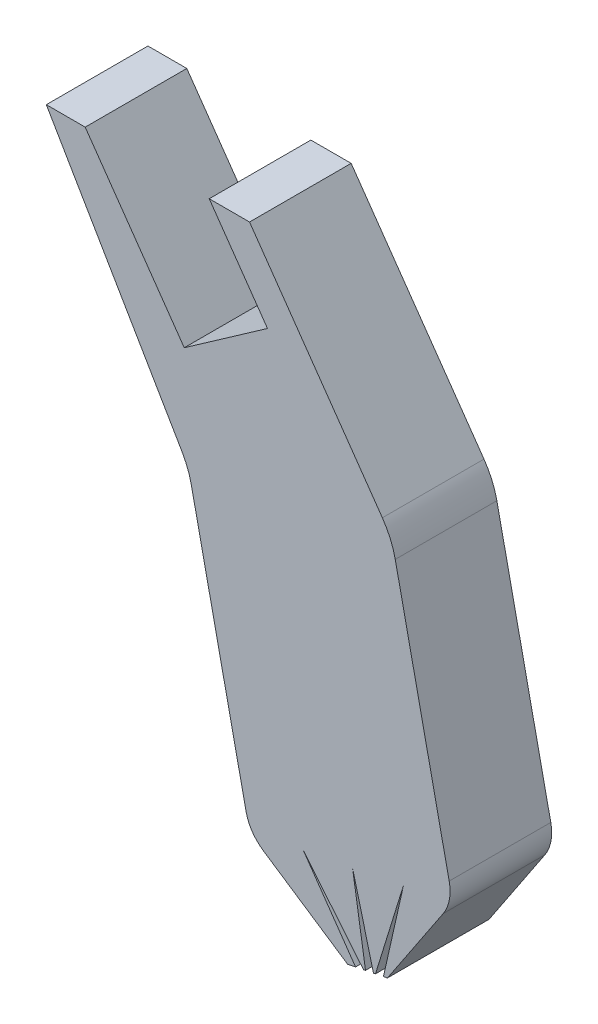
ISO-10303-21;
HEADER;
FILE_DESCRIPTION(('STEP AP214'),'2;1');
FILE_NAME('part.step','',(''),(''),'','','');
FILE_SCHEMA(('AUTOMOTIVE_DESIGN { 1 0 10303 214 1 1 1 1 }'));
ENDSEC;
DATA;
#1=APPLICATION_CONTEXT('core data for automotive mechanical design processes');
#2=APPLICATION_PROTOCOL_DEFINITION('international standard','automotive_design',2000,#1);
#3=PRODUCT_CONTEXT('',#1,'mechanical');
#4=PRODUCT('Part','Part','',(#3));
#5=PRODUCT_RELATED_PRODUCT_CATEGORY('part','',(#4));
#6=PRODUCT_DEFINITION_FORMATION('','',#4);
#7=PRODUCT_DEFINITION_CONTEXT('part definition',#1,'design');
#8=PRODUCT_DEFINITION('design','',#6,#7);
#9=PRODUCT_DEFINITION_SHAPE('','',#8);
#10=(LENGTH_UNIT() NAMED_UNIT(*) SI_UNIT(.MILLI.,.METRE.));
#11=(NAMED_UNIT(*) PLANE_ANGLE_UNIT() SI_UNIT($,.RADIAN.));
#12=(NAMED_UNIT(*) SI_UNIT($,.STERADIAN.) SOLID_ANGLE_UNIT());
#13=UNCERTAINTY_MEASURE_WITH_UNIT(LENGTH_MEASURE(1.E-05),#10,'distance_accuracy_value','');
#14=(GEOMETRIC_REPRESENTATION_CONTEXT(3) GLOBAL_UNCERTAINTY_ASSIGNED_CONTEXT((#13)) GLOBAL_UNIT_ASSIGNED_CONTEXT((#10,
#11,#12)) REPRESENTATION_CONTEXT('',''));
#15=CARTESIAN_POINT('',(0.,0.,0.));
#16=DIRECTION('',(0.,0.,1.));
#17=DIRECTION('',(1.,0.,0.));
#18=AXIS2_PLACEMENT_3D('',#15,#16,#17);
#19=CARTESIAN_POINT('',(7.01256561130721,-61.1492493326048,13.75));
#20=DIRECTION('',(0.,-1.,0.));
#21=DIRECTION('',(0.,0.,-1.));
#22=AXIS2_PLACEMENT_3D('',#19,#20,#21);
#23=PLANE('',#22);
#24=DIRECTION('',(-1.,0.,0.));
#25=VECTOR('',#24,1.);
#26=CARTESIAN_POINT('',(7.01256561130721,-61.1492493326048,13.75));
#27=LINE('',#26,#25);
#28=CARTESIAN_POINT('',(2.96914406359542,-61.1492493326048,13.75));
#29=VERTEX_POINT('',#28);
#30=CARTESIAN_POINT('',(2.01256561130721,-61.1492493326048,13.75));
#31=VERTEX_POINT('',#30);
#32=EDGE_CURVE('E350',#29,#31,#27,.T.);
#33=ORIENTED_EDGE('',*,*,#32,.F.);
#34=DIRECTION('',(0.,0.,-1.));
#35=VECTOR('',#34,1.);
#36=CARTESIAN_POINT('',(2.96914406359542,-61.1492493326048,13.751));
#37=LINE('',#36,#35);
#38=CARTESIAN_POINT('',(2.96914406359542,-61.1492493326048,11.25));
#39=VERTEX_POINT('',#38);
#40=EDGE_CURVE('E453',#29,#39,#37,.T.);
#41=ORIENTED_EDGE('',*,*,#40,.T.);
#42=DIRECTION('',(-1.,0.,0.));
#43=VECTOR('',#42,1.);
#44=CARTESIAN_POINT('',(7.01256561130721,-61.1492493326048,11.25));
#45=LINE('',#44,#43);
#46=CARTESIAN_POINT('',(2.01256561130721,-61.1492493326048,11.25));
#47=VERTEX_POINT('',#46);
#48=EDGE_CURVE('E253',#39,#47,#45,.T.);
#49=ORIENTED_EDGE('',*,*,#48,.T.);
#50=DIRECTION('',(0.,0.,-1.));
#51=VECTOR('',#50,1.);
#52=CARTESIAN_POINT('',(2.01256561130721,-61.1492493326048,13.75));
#53=LINE('',#52,#51);
#54=EDGE_CURVE('E277',#31,#47,#53,.T.);
#55=ORIENTED_EDGE('',*,*,#54,.F.);
#56=EDGE_LOOP('',(#33,#41,#49,#55));
#57=FACE_BOUND('',#56,.T.);
#58=ADVANCED_FACE('F57',(#57),#23,.F.);
#59=CARTESIAN_POINT('',(7.01256561130721,-61.1492493326048,13.75));
#60=DIRECTION('',(0.,0.,-1.));
#61=DIRECTION('',(-1.,0.,0.));
#62=AXIS2_PLACEMENT_3D('',#59,#60,#61);
#63=PLANE('',#62);
#64=DIRECTION('',(0.819231920519041,0.573462344363328,0.));
#65=VECTOR('',#64,1.);
#66=CARTESIAN_POINT('',(7.45443882843717,-63.1973291339024,13.75));
#67=LINE('',#66,#65);
#68=CARTESIAN_POINT('',(5.40635902713957,-64.6309849948108,13.75));
#69=VERTEX_POINT('',#68);
#70=CARTESIAN_POINT('',(7.45443882843717,-63.1973291339024,13.75));
#71=VERTEX_POINT('',#70);
#72=EDGE_CURVE('E470',#69,#71,#67,.T.);
#73=ORIENTED_EDGE('',*,*,#72,.F.);
#74=DIRECTION('',(0.573462344363329,-0.81923192051904,0.));
#75=VECTOR('',#74,1.);
#76=CARTESIAN_POINT('',(5.40635902713957,-64.6309849948108,13.75));
#77=LINE('',#76,#75);
#78=EDGE_CURVE('E246',#29,#69,#77,.T.);
#79=ORIENTED_EDGE('',*,*,#78,.F.);
#80=ORIENTED_EDGE('',*,*,#32,.T.);
#81=DIRECTION('',(0.503871025524086,-0.863778900898433,0.));
#82=VECTOR('',#81,1.);
#83=CARTESIAN_POINT('',(2.01256561130721,-61.1492493326048,13.75));
#84=LINE('',#83,#82);
#85=CARTESIAN_POINT('',(5.3514971074723,-66.8731318974593,13.75));
#86=VERTEX_POINT('',#85);
#87=EDGE_CURVE('E343',#31,#86,#84,.T.);
#88=ORIENTED_EDGE('',*,*,#87,.T.);
#89=CARTESIAN_POINT('',(3.62393930567543,-67.8808739485075,13.75));
#90=DIRECTION('',(0.,0.,-1.));
#91=DIRECTION('',(-1.,0.,0.));
#92=AXIS2_PLACEMENT_3D('',#89,#90,#91);
#93=CIRCLE('',#92,2.);
#94=CARTESIAN_POINT('',(5.57954413383025,-67.4618157710457,13.75));
#95=VERTEX_POINT('',#94);
#96=EDGE_CURVE('E322',#86,#95,#93,.T.);
#97=ORIENTED_EDGE('',*,*,#96,.T.);
#98=DIRECTION('',(0.209529088730873,-0.97780241407741,0.));
#99=VECTOR('',#98,1.);
#100=CARTESIAN_POINT('',(5.51256561130721,-67.1492493326048,13.75));
#101=LINE('',#100,#99);
#102=CARTESIAN_POINT('',(6.92745234621416,-73.752054095504,13.75));
#103=VERTEX_POINT('',#102);
#104=EDGE_CURVE('E340',#95,#103,#101,.T.);
#105=ORIENTED_EDGE('',*,*,#104,.T.);
#106=CARTESIAN_POINT('',(7.90525476029157,-73.5425250067731,13.75));
#107=DIRECTION('',(0.,0.,-1.));
#108=DIRECTION('',(-1.,0.,0.));
#109=AXIS2_PLACEMENT_3D('',#106,#107,#108);
#110=CIRCLE('',#109,1.);
#111=CARTESIAN_POINT('',(7.35055456406634,-74.3745753011109,13.75));
#112=VERTEX_POINT('',#111);
#113=EDGE_CURVE('E302',#103,#112,#110,.F.);
#114=ORIENTED_EDGE('',*,*,#113,.T.);
#115=DIRECTION('',(0.832050294337844,-0.554700196225228,0.));
#116=VECTOR('',#115,1.);
#117=CARTESIAN_POINT('',(7.01256561130721,-74.1492493326049,13.75));
#118=LINE('',#117,#116);
#119=CARTESIAN_POINT('',(9.42421720589266,-75.7570170623285,13.75));
#120=VERTEX_POINT('',#119);
#121=EDGE_CURVE('E337',#112,#120,#118,.T.);
#122=ORIENTED_EDGE('',*,*,#121,.T.);
#123=DIRECTION('',(0.98058067569092,0.196116135138183,0.));
#124=VECTOR('',#123,1.);
#125=CARTESIAN_POINT('',(9.42421720589266,-75.7570170623285,13.75));
#126=LINE('',#125,#124);
#127=CARTESIAN_POINT('',(9.62033334103085,-75.7177938353008,13.75));
#128=VERTEX_POINT('',#127);
#129=EDGE_CURVE('E362',#120,#128,#126,.T.);
#130=ORIENTED_EDGE('',*,*,#129,.T.);
#131=DIRECTION('',(0.571787228868899,-0.820401953253663,0.));
#132=VECTOR('',#131,1.);
#133=CARTESIAN_POINT('',(1.93371148372192,-64.6890067843322,13.75));
#134=LINE('',#133,#132);
#135=CARTESIAN_POINT('',(8.34183175812095,-73.8833961032422,13.75));
#136=VERTEX_POINT('',#135);
#137=EDGE_CURVE('E409',#136,#128,#134,.T.);
#138=ORIENTED_EDGE('',*,*,#137,.F.);
#139=DIRECTION('',(-0.634742016422739,0.772724124502138,0.));
#140=VECTOR('',#139,1.);
#141=CARTESIAN_POINT('',(1.5604235678015,-65.6278252237713,13.75));
#142=LINE('',#141,#140);
#143=CARTESIAN_POINT('',(9.81644947616903,-75.6785706082732,13.75));
#144=VERTEX_POINT('',#143);
#145=EDGE_CURVE('E419',#144,#136,#142,.T.);
#146=ORIENTED_EDGE('',*,*,#145,.F.);
#147=CARTESIAN_POINT('',(9.86547850995357,-75.6687648015163,13.75));
#148=VERTEX_POINT('',#147);
#149=EDGE_CURVE('E376',#144,#148,#126,.T.);
#150=ORIENTED_EDGE('',*,*,#149,.T.);
#151=DIRECTION('',(0.155359100364853,-0.987858061633261,0.));
#152=VECTOR('',#151,1.);
#153=CARTESIAN_POINT('',(7.56826950147012,-61.0618545339004,13.75));
#154=LINE('',#153,#152);
#155=CARTESIAN_POINT('',(9.54679539118253,-73.6424033766298,13.75));
#156=VERTEX_POINT('',#155);
#157=EDGE_CURVE('E382',#156,#148,#154,.T.);
#158=ORIENTED_EDGE('',*,*,#157,.F.);
#159=DIRECTION('',(-0.250786539192191,0.968042412170047,0.));
#160=VECTOR('',#159,1.);
#161=CARTESIAN_POINT('',(6.35441975385762,-61.3197523186295,13.75));
#162=LINE('',#161,#160);
#163=CARTESIAN_POINT('',(10.0615946450918,-75.6295415744886,13.75));
#164=VERTEX_POINT('',#163);
#165=EDGE_CURVE('E394',#164,#156,#162,.T.);
#166=ORIENTED_EDGE('',*,*,#165,.F.);
#167=CARTESIAN_POINT('',(10.1106236788763,-75.6197357677317,13.75));
#168=VERTEX_POINT('',#167);
#169=EDGE_CURVE('E485',#164,#168,#126,.T.);
#170=ORIENTED_EDGE('',*,*,#169,.T.);
#171=DIRECTION('',(0.295420455509128,0.955367340067044,0.));
#172=VECTOR('',#171,1.);
#173=CARTESIAN_POINT('',(13.9243246281971,-63.2865162366584,13.75));
#174=LINE('',#173,#172);
#175=CARTESIAN_POINT('',(10.799532813685,-73.3918558921293,13.75));
#176=VERTEX_POINT('',#175);
#177=EDGE_CURVE('E442',#168,#176,#174,.T.);
#178=ORIENTED_EDGE('',*,*,#177,.T.);
#179=DIRECTION('',(-0.219658671350537,-0.975576787393241,0.));
#180=VECTOR('',#179,1.);
#181=CARTESIAN_POINT('',(13.2403278211245,-62.5514782398248,13.75));
#182=LINE('',#181,#180);
#183=CARTESIAN_POINT('',(10.3067398140145,-75.5805125407041,13.75));
#184=VERTEX_POINT('',#183);
#185=EDGE_CURVE('E432',#176,#184,#182,.T.);
#186=ORIENTED_EDGE('',*,*,#185,.T.);
#187=CARTESIAN_POINT('',(10.4047978815836,-75.5609009271903,13.75));
#188=VERTEX_POINT('',#187);
#189=EDGE_CURVE('E370',#184,#188,#126,.T.);
#190=ORIENTED_EDGE('',*,*,#189,.T.);
#191=DIRECTION('',(0.554700196225229,0.832050294337844,0.));
#192=VECTOR('',#191,1.);
#193=CARTESIAN_POINT('',(10.0125656113072,-76.1492493326048,13.75));
#194=LINE('',#193,#192);
#195=CARTESIAN_POINT('',(11.7783376366465,-73.5005912945958,13.75));
#196=VERTEX_POINT('',#195);
#197=EDGE_CURVE('E334',#188,#196,#194,.T.);
#198=ORIENTED_EDGE('',*,*,#197,.T.);
#199=CARTESIAN_POINT('',(10.9462873423087,-72.9458910983706,13.75));
#200=DIRECTION('',(0.,0.,-1.));
#201=DIRECTION('',(-1.,0.,0.));
#202=AXIS2_PLACEMENT_3D('',#199,#200,#201);
#203=CIRCLE('',#202,1.);
#204=CARTESIAN_POINT('',(11.9240897563861,-72.7363620096397,13.75));
#205=VERTEX_POINT('',#204);
#206=EDGE_CURVE('E299',#196,#205,#203,.F.);
#207=ORIENTED_EDGE('',*,*,#206,.T.);
#208=DIRECTION('',(-0.209529088730873,0.97780241407741,0.));
#209=VECTOR('',#208,1.);
#210=CARTESIAN_POINT('',(12.0125656113072,-73.1492493326048,13.75));
#211=LINE('',#210,#209);
#212=CARTESIAN_POINT('',(10.5974327748816,-66.5452960959522,13.75));
#213=VERTEX_POINT('',#212);
#214=EDGE_CURVE('E281',#205,#213,#211,.T.);
#215=ORIENTED_EDGE('',*,*,#214,.T.);
#216=CARTESIAN_POINT('',(8.64182794672682,-66.9643542734139,13.75));
#217=DIRECTION('',(0.,0.,-1.));
#218=DIRECTION('',(-1.,0.,0.));
#219=AXIS2_PLACEMENT_3D('',#216,#217,#218);
#220=CIRCLE('',#219,2.);
#221=CARTESIAN_POINT('',(10.2802917877649,-65.8174295846872,13.75));
#222=VERTEX_POINT('',#221);
#223=EDGE_CURVE('E12',#213,#222,#220,.F.);
#224=ORIENTED_EDGE('',*,*,#223,.T.);
#225=DIRECTION('',(-0.573462344363329,0.81923192051904,0.));
#226=VECTOR('',#225,1.);
#227=CARTESIAN_POINT('',(10.5125656113072,-66.1492493326048,13.75));
#228=LINE('',#227,#226);
#229=CARTESIAN_POINT('',(7.01256561130721,-61.1492493326048,13.75));
#230=VERTEX_POINT('',#229);
#231=EDGE_CURVE('E276',#222,#230,#228,.T.);
#232=ORIENTED_EDGE('',*,*,#231,.T.);
#233=CARTESIAN_POINT('',(6.02078296752884,-61.1492493326048,13.75));
#234=VERTEX_POINT('',#233);
#235=EDGE_CURVE('E347',#230,#234,#27,.T.);
#236=ORIENTED_EDGE('',*,*,#235,.T.);
#237=DIRECTION('',(-0.57346234436333,0.819231920519039,0.));
#238=VECTOR('',#237,1.);
#239=CARTESIAN_POINT('',(6.02078296752884,-61.1492493326048,13.75));
#240=LINE('',#239,#238);
#241=EDGE_CURVE('E73',#71,#234,#240,.T.);
#242=ORIENTED_EDGE('',*,*,#241,.F.);
#243=EDGE_LOOP('',(#73,#79,#80,#88,#97,#105,#114,#122,#130,#138,#146,#150,#158,#166,#170,#178,
#186,#190,#198,#207,#215,#224,#232,#236,#242));
#244=FACE_BOUND('',#243,.T.);
#245=ADVANCED_FACE('F477',(#244),#63,.F.);
#246=CARTESIAN_POINT('',(7.01256561130721,-61.1492493326048,11.25));
#247=DIRECTION('',(0.,0.,-1.));
#248=DIRECTION('',(-1.,0.,0.));
#249=AXIS2_PLACEMENT_3D('',#246,#247,#248);
#250=PLANE('',#249);
#251=DIRECTION('',(-0.573462344363329,0.81923192051904,0.));
#252=VECTOR('',#251,1.);
#253=CARTESIAN_POINT('',(5.40635902713957,-64.6309849948108,11.25));
#254=LINE('',#253,#252);
#255=CARTESIAN_POINT('',(5.40635902713957,-64.6309849948108,11.25));
#256=VERTEX_POINT('',#255);
#257=EDGE_CURVE('E234',#256,#39,#254,.T.);
#258=ORIENTED_EDGE('',*,*,#257,.F.);
#259=DIRECTION('',(-0.81923192051904,-0.573462344363328,0.));
#260=VECTOR('',#259,1.);
#261=CARTESIAN_POINT('',(7.45443882843717,-63.1973291339024,11.25));
#262=LINE('',#261,#260);
#263=CARTESIAN_POINT('',(7.45443882843717,-63.1973291339024,11.25));
#264=VERTEX_POINT('',#263);
#265=EDGE_CURVE('E244',#264,#256,#262,.T.);
#266=ORIENTED_EDGE('',*,*,#265,.F.);
#267=DIRECTION('',(0.57346234436333,-0.819231920519039,0.));
#268=VECTOR('',#267,1.);
#269=CARTESIAN_POINT('',(6.02078296752884,-61.1492493326048,11.25));
#270=LINE('',#269,#268);
#271=CARTESIAN_POINT('',(6.02078296752884,-61.1492493326048,11.25));
#272=VERTEX_POINT('',#271);
#273=EDGE_CURVE('E226',#272,#264,#270,.T.);
#274=ORIENTED_EDGE('',*,*,#273,.F.);
#275=CARTESIAN_POINT('',(7.01256561130721,-61.1492493326048,11.25));
#276=VERTEX_POINT('',#275);
#277=EDGE_CURVE('E241',#276,#272,#45,.T.);
#278=ORIENTED_EDGE('',*,*,#277,.F.);
#279=DIRECTION('',(-0.573462344363329,0.81923192051904,0.));
#280=VECTOR('',#279,1.);
#281=CARTESIAN_POINT('',(10.5125656113072,-66.1492493326048,11.25));
#282=LINE('',#281,#280);
#283=CARTESIAN_POINT('',(10.2802917877649,-65.8174295846872,11.25));
#284=VERTEX_POINT('',#283);
#285=EDGE_CURVE('E260',#284,#276,#282,.T.);
#286=ORIENTED_EDGE('',*,*,#285,.F.);
#287=CARTESIAN_POINT('',(8.64182794672682,-66.9643542734139,11.25));
#288=DIRECTION('',(0.,0.,-1.));
#289=DIRECTION('',(-1.,0.,0.));
#290=AXIS2_PLACEMENT_3D('',#287,#288,#289);
#291=CIRCLE('',#290,2.);
#292=CARTESIAN_POINT('',(10.5974327748816,-66.5452960959522,11.25));
#293=VERTEX_POINT('',#292);
#294=EDGE_CURVE('E329',#284,#293,#291,.T.);
#295=ORIENTED_EDGE('',*,*,#294,.T.);
#296=DIRECTION('',(-0.209529088730873,0.97780241407741,0.));
#297=VECTOR('',#296,1.);
#298=CARTESIAN_POINT('',(12.0125656113072,-73.1492493326048,11.25));
#299=LINE('',#298,#297);
#300=CARTESIAN_POINT('',(11.9240897563861,-72.7363620096397,11.25));
#301=VERTEX_POINT('',#300);
#302=EDGE_CURVE('E273',#301,#293,#299,.T.);
#303=ORIENTED_EDGE('',*,*,#302,.F.);
#304=CARTESIAN_POINT('',(10.9462873423087,-72.9458910983706,11.25));
#305=DIRECTION('',(0.,0.,-1.));
#306=DIRECTION('',(-1.,0.,0.));
#307=AXIS2_PLACEMENT_3D('',#304,#305,#306);
#308=CIRCLE('',#307,1.);
#309=CARTESIAN_POINT('',(11.7783376366465,-73.5005912945958,11.25));
#310=VERTEX_POINT('',#309);
#311=EDGE_CURVE('E288',#301,#310,#308,.T.);
#312=ORIENTED_EDGE('',*,*,#311,.T.);
#313=DIRECTION('',(0.554700196225229,0.832050294337844,0.));
#314=VECTOR('',#313,1.);
#315=CARTESIAN_POINT('',(10.0125656113072,-76.1492493326048,11.25));
#316=LINE('',#315,#314);
#317=CARTESIAN_POINT('',(10.4047978815836,-75.5609009271903,11.25));
#318=VERTEX_POINT('',#317);
#319=EDGE_CURVE('E269',#318,#310,#316,.T.);
#320=ORIENTED_EDGE('',*,*,#319,.F.);
#321=DIRECTION('',(0.98058067569092,0.196116135138183,0.));
#322=VECTOR('',#321,1.);
#323=CARTESIAN_POINT('',(9.42421720589266,-75.7570170623285,11.25));
#324=LINE('',#323,#322);
#325=CARTESIAN_POINT('',(10.3067398140145,-75.5805125407041,11.25));
#326=VERTEX_POINT('',#325);
#327=EDGE_CURVE('E372',#326,#318,#324,.T.);
#328=ORIENTED_EDGE('',*,*,#327,.F.);
#329=DIRECTION('',(-0.219658671350537,-0.975576787393241,0.));
#330=VECTOR('',#329,1.);
#331=CARTESIAN_POINT('',(13.2403278211245,-62.5514782398248,11.25));
#332=LINE('',#331,#330);
#333=CARTESIAN_POINT('',(10.799532813685,-73.3918558921293,11.25));
#334=VERTEX_POINT('',#333);
#335=EDGE_CURVE('E439',#334,#326,#332,.T.);
#336=ORIENTED_EDGE('',*,*,#335,.F.);
#337=DIRECTION('',(0.295420455509128,0.955367340067044,0.));
#338=VECTOR('',#337,1.);
#339=CARTESIAN_POINT('',(13.9243246281971,-63.2865162366584,11.25));
#340=LINE('',#339,#338);
#341=CARTESIAN_POINT('',(10.1106236788763,-75.6197357677317,11.25));
#342=VERTEX_POINT('',#341);
#343=EDGE_CURVE('E389',#342,#334,#340,.T.);
#344=ORIENTED_EDGE('',*,*,#343,.F.);
#345=CARTESIAN_POINT('',(10.0615946450918,-75.6295415744886,11.25));
#346=VERTEX_POINT('',#345);
#347=EDGE_CURVE('E491',#346,#342,#324,.T.);
#348=ORIENTED_EDGE('',*,*,#347,.F.);
#349=DIRECTION('',(-0.250786539192191,0.968042412170047,0.));
#350=VECTOR('',#349,1.);
#351=CARTESIAN_POINT('',(6.35441975385762,-61.3197523186295,11.25));
#352=LINE('',#351,#350);
#353=CARTESIAN_POINT('',(9.54679539118253,-73.6424033766298,11.25));
#354=VERTEX_POINT('',#353);
#355=EDGE_CURVE('E395',#346,#354,#352,.T.);
#356=ORIENTED_EDGE('',*,*,#355,.T.);
#357=DIRECTION('',(0.155359100364853,-0.987858061633261,0.));
#358=VECTOR('',#357,1.);
#359=CARTESIAN_POINT('',(7.56826950147012,-61.0618545339004,11.25));
#360=LINE('',#359,#358);
#361=CARTESIAN_POINT('',(9.86547850995357,-75.6687648015163,11.25));
#362=VERTEX_POINT('',#361);
#363=EDGE_CURVE('E390',#354,#362,#360,.T.);
#364=ORIENTED_EDGE('',*,*,#363,.T.);
#365=CARTESIAN_POINT('',(9.81644947616903,-75.6785706082732,11.25));
#366=VERTEX_POINT('',#365);
#367=EDGE_CURVE('E371',#366,#362,#324,.T.);
#368=ORIENTED_EDGE('',*,*,#367,.F.);
#369=DIRECTION('',(-0.634742016422739,0.772724124502138,0.));
#370=VECTOR('',#369,1.);
#371=CARTESIAN_POINT('',(1.5604235678015,-65.6278252237713,11.25));
#372=LINE('',#371,#370);
#373=CARTESIAN_POINT('',(8.34183175812095,-73.8833961032422,11.25));
#374=VERTEX_POINT('',#373);
#375=EDGE_CURVE('E420',#366,#374,#372,.T.);
#376=ORIENTED_EDGE('',*,*,#375,.T.);
#377=DIRECTION('',(0.571787228868899,-0.820401953253663,0.));
#378=VECTOR('',#377,1.);
#379=CARTESIAN_POINT('',(1.93371148372192,-64.6890067843322,11.25));
#380=LINE('',#379,#378);
#381=CARTESIAN_POINT('',(9.62033334103084,-75.7177938353008,11.25));
#382=VERTEX_POINT('',#381);
#383=EDGE_CURVE('E415',#374,#382,#380,.T.);
#384=ORIENTED_EDGE('',*,*,#383,.T.);
#385=CARTESIAN_POINT('',(9.42421720589266,-75.7570170623285,11.25));
#386=VERTEX_POINT('',#385);
#387=EDGE_CURVE('E366',#386,#382,#324,.T.);
#388=ORIENTED_EDGE('',*,*,#387,.F.);
#389=DIRECTION('',(0.832050294337844,-0.554700196225228,0.));
#390=VECTOR('',#389,1.);
#391=CARTESIAN_POINT('',(7.01256561130721,-74.1492493326049,11.25));
#392=LINE('',#391,#390);
#393=CARTESIAN_POINT('',(7.35055456406634,-74.3745753011109,11.25));
#394=VERTEX_POINT('',#393);
#395=EDGE_CURVE('E266',#394,#386,#392,.T.);
#396=ORIENTED_EDGE('',*,*,#395,.F.);
#397=CARTESIAN_POINT('',(7.90525476029157,-73.5425250067731,11.25));
#398=DIRECTION('',(0.,0.,-1.));
#399=DIRECTION('',(-1.,0.,0.));
#400=AXIS2_PLACEMENT_3D('',#397,#398,#399);
#401=CIRCLE('',#400,1.);
#402=CARTESIAN_POINT('',(6.92745234621416,-73.752054095504,11.25));
#403=VERTEX_POINT('',#402);
#404=EDGE_CURVE('E291',#394,#403,#401,.T.);
#405=ORIENTED_EDGE('',*,*,#404,.T.);
#406=DIRECTION('',(0.209529088730873,-0.97780241407741,0.));
#407=VECTOR('',#406,1.);
#408=CARTESIAN_POINT('',(5.51256561130721,-67.1492493326048,11.25));
#409=LINE('',#408,#407);
#410=CARTESIAN_POINT('',(5.57954413383025,-67.4618157710457,11.25));
#411=VERTEX_POINT('',#410);
#412=EDGE_CURVE('E258',#411,#403,#409,.T.);
#413=ORIENTED_EDGE('',*,*,#412,.F.);
#414=CARTESIAN_POINT('',(3.62393930567543,-67.8808739485075,11.25));
#415=DIRECTION('',(0.,0.,-1.));
#416=DIRECTION('',(-1.,0.,0.));
#417=AXIS2_PLACEMENT_3D('',#414,#415,#416);
#418=CIRCLE('',#417,2.);
#419=CARTESIAN_POINT('',(5.3514971074723,-66.8731318974593,11.25));
#420=VERTEX_POINT('',#419);
#421=EDGE_CURVE('E319',#411,#420,#418,.F.);
#422=ORIENTED_EDGE('',*,*,#421,.T.);
#423=DIRECTION('',(0.503871025524086,-0.863778900898433,0.));
#424=VECTOR('',#423,1.);
#425=CARTESIAN_POINT('',(2.01256561130721,-61.1492493326048,11.25));
#426=LINE('',#425,#424);
#427=EDGE_CURVE('E252',#47,#420,#426,.T.);
#428=ORIENTED_EDGE('',*,*,#427,.F.);
#429=ORIENTED_EDGE('',*,*,#48,.F.);
#430=EDGE_LOOP('',(#258,#266,#274,#278,#286,#295,#303,#312,#320,#328,#336,#344,#348,#356,#364,
#368,#376,#384,#388,#396,#405,#413,#422,#428,#429));
#431=FACE_BOUND('',#430,.T.);
#432=ADVANCED_FACE('F239',(#431),#250,.T.);
#433=CARTESIAN_POINT('',(9.42421720589266,-75.7570170623285,13.75));
#434=DIRECTION('',(-0.196116135138183,0.98058067569092,0.));
#435=DIRECTION('',(-0.98058067569092,-0.196116135138183,0.));
#436=AXIS2_PLACEMENT_3D('',#433,#434,#435);
#437=PLANE('',#436);
#438=ORIENTED_EDGE('',*,*,#189,.F.);
#439=DIRECTION('',(0.,0.,-1.));
#440=VECTOR('',#439,1.);
#441=CARTESIAN_POINT('',(10.3067398140145,-75.5805125407041,13.75));
#442=LINE('',#441,#440);
#443=EDGE_CURVE('E435',#184,#326,#442,.T.);
#444=ORIENTED_EDGE('',*,*,#443,.T.);
#445=ORIENTED_EDGE('',*,*,#327,.T.);
#446=DIRECTION('',(0.,0.,-1.));
#447=VECTOR('',#446,1.);
#448=CARTESIAN_POINT('',(10.4047978815836,-75.5609009271903,13.75));
#449=LINE('',#448,#447);
#450=EDGE_CURVE('E361',#188,#318,#449,.T.);
#451=ORIENTED_EDGE('',*,*,#450,.F.);
#452=EDGE_LOOP('',(#438,#444,#445,#451));
#453=FACE_BOUND('',#452,.T.);
#454=ADVANCED_FACE('F498',(#453),#437,.F.);
#455=DIRECTION('',(0.,0.,-1.));
#456=VECTOR('',#455,1.);
#457=CARTESIAN_POINT('',(9.81644947616903,-75.6785706082732,13.75));
#458=LINE('',#457,#456);
#459=EDGE_CURVE('E404',#144,#366,#458,.T.);
#460=ORIENTED_EDGE('',*,*,#459,.T.);
#461=ORIENTED_EDGE('',*,*,#367,.T.);
#462=DIRECTION('',(0.,0.,-1.));
#463=VECTOR('',#462,1.);
#464=CARTESIAN_POINT('',(9.86547850995357,-75.6687648015163,13.75));
#465=LINE('',#464,#463);
#466=EDGE_CURVE('E381',#148,#362,#465,.T.);
#467=ORIENTED_EDGE('',*,*,#466,.F.);
#468=ORIENTED_EDGE('',*,*,#149,.F.);
#469=EDGE_LOOP('',(#460,#461,#467,#468));
#470=FACE_BOUND('',#469,.T.);
#471=ADVANCED_FACE('F643',(#470),#437,.F.);
#472=DIRECTION('',(0.,0.,-1.));
#473=VECTOR('',#472,1.);
#474=CARTESIAN_POINT('',(9.62033334103084,-75.7177938353008,13.75));
#475=LINE('',#474,#473);
#476=EDGE_CURVE('E408',#128,#382,#475,.T.);
#477=ORIENTED_EDGE('',*,*,#476,.F.);
#478=ORIENTED_EDGE('',*,*,#129,.F.);
#479=DIRECTION('',(0.,0.,-1.));
#480=VECTOR('',#479,1.);
#481=CARTESIAN_POINT('',(9.42421720589266,-75.7570170623285,13.75));
#482=LINE('',#481,#480);
#483=EDGE_CURVE('E357',#120,#386,#482,.T.);
#484=ORIENTED_EDGE('',*,*,#483,.T.);
#485=ORIENTED_EDGE('',*,*,#387,.T.);
#486=EDGE_LOOP('',(#477,#478,#484,#485));
#487=FACE_BOUND('',#486,.T.);
#488=ADVANCED_FACE('F545',(#487),#437,.F.);
#489=ORIENTED_EDGE('',*,*,#347,.T.);
#490=DIRECTION('',(0.,0.,-1.));
#491=VECTOR('',#490,1.);
#492=CARTESIAN_POINT('',(10.1106236788763,-75.6197357677317,13.75));
#493=LINE('',#492,#491);
#494=EDGE_CURVE('E428',#168,#342,#493,.T.);
#495=ORIENTED_EDGE('',*,*,#494,.F.);
#496=ORIENTED_EDGE('',*,*,#169,.F.);
#497=DIRECTION('',(0.,0.,-1.));
#498=VECTOR('',#497,1.);
#499=CARTESIAN_POINT('',(10.0615946450918,-75.6295415744886,13.75));
#500=LINE('',#499,#498);
#501=EDGE_CURVE('E377',#164,#346,#500,.T.);
#502=ORIENTED_EDGE('',*,*,#501,.T.);
#503=EDGE_LOOP('',(#489,#495,#496,#502));
#504=FACE_BOUND('',#503,.T.);
#505=ADVANCED_FACE('F541',(#504),#437,.F.);
#506=CARTESIAN_POINT('',(10.5125656113072,-66.1492493326048,13.75));
#507=DIRECTION('',(-0.81923192051904,-0.573462344363329,0.));
#508=DIRECTION('',(0.573462344363329,-0.81923192051904,0.));
#509=AXIS2_PLACEMENT_3D('',#506,#507,#508);
#510=PLANE('',#509);
#511=ORIENTED_EDGE('',*,*,#231,.F.);
#512=DIRECTION('',(0.,0.,-1.));
#513=VECTOR('',#512,1.);
#514=CARTESIAN_POINT('',(10.2802917877649,-65.8174295846872,13.75));
#515=LINE('',#514,#513);
#516=EDGE_CURVE('E325',#222,#284,#515,.T.);
#517=ORIENTED_EDGE('',*,*,#516,.T.);
#518=ORIENTED_EDGE('',*,*,#285,.T.);
#519=DIRECTION('',(0.,0.,-1.));
#520=VECTOR('',#519,1.);
#521=CARTESIAN_POINT('',(7.01256561130721,-61.1492493326048,13.75));
#522=LINE('',#521,#520);
#523=EDGE_CURVE('E250',#230,#276,#522,.T.);
#524=ORIENTED_EDGE('',*,*,#523,.F.);
#525=EDGE_LOOP('',(#511,#517,#518,#524));
#526=FACE_BOUND('',#525,.T.);
#527=ADVANCED_FACE('F479',(#526),#510,.F.);
#528=ORIENTED_EDGE('',*,*,#277,.T.);
#529=DIRECTION('',(0.,0.,-1.));
#530=VECTOR('',#529,1.);
#531=CARTESIAN_POINT('',(6.02078296752884,-61.1492493326048,13.751));
#532=LINE('',#531,#530);
#533=EDGE_CURVE('E223',#234,#272,#532,.T.);
#534=ORIENTED_EDGE('',*,*,#533,.F.);
#535=ORIENTED_EDGE('',*,*,#235,.F.);
#536=ORIENTED_EDGE('',*,*,#523,.T.);
#537=EDGE_LOOP('',(#528,#534,#535,#536));
#538=FACE_BOUND('',#537,.T.);
#539=ADVANCED_FACE('F248',(#538),#23,.F.);
#540=CARTESIAN_POINT('',(2.01256561130721,-61.1492493326048,13.75));
#541=DIRECTION('',(0.863778900898433,0.503871025524086,0.));
#542=DIRECTION('',(-0.503871025524086,0.863778900898433,0.));
#543=AXIS2_PLACEMENT_3D('',#540,#541,#542);
#544=PLANE('',#543);
#545=ORIENTED_EDGE('',*,*,#427,.T.);
#546=DIRECTION('',(0.,0.,-1.));
#547=VECTOR('',#546,1.);
#548=CARTESIAN_POINT('',(5.3514971074723,-66.8731318974593,13.75));
#549=LINE('',#548,#547);
#550=EDGE_CURVE('E316',#420,#86,#549,.F.);
#551=ORIENTED_EDGE('',*,*,#550,.T.);
#552=ORIENTED_EDGE('',*,*,#87,.F.);
#553=ORIENTED_EDGE('',*,*,#54,.T.);
#554=EDGE_LOOP('',(#545,#551,#552,#553));
#555=FACE_BOUND('',#554,.T.);
#556=ADVANCED_FACE('F534',(#555),#544,.F.);
#557=CARTESIAN_POINT('',(5.51256561130721,-67.1492493326048,13.75));
#558=DIRECTION('',(0.97780241407741,0.209529088730873,0.));
#559=DIRECTION('',(-0.209529088730873,0.97780241407741,0.));
#560=AXIS2_PLACEMENT_3D('',#557,#558,#559);
#561=PLANE('',#560);
#562=ORIENTED_EDGE('',*,*,#104,.F.);
#563=DIRECTION('',(0.,0.,-1.));
#564=VECTOR('',#563,1.);
#565=CARTESIAN_POINT('',(5.57954413383025,-67.4618157710457,11.25));
#566=LINE('',#565,#564);
#567=EDGE_CURVE('E312',#95,#411,#566,.T.);
#568=ORIENTED_EDGE('',*,*,#567,.T.);
#569=ORIENTED_EDGE('',*,*,#412,.T.);
#570=DIRECTION('',(0.,0.,-1.));
#571=VECTOR('',#570,1.);
#572=CARTESIAN_POINT('',(6.92745234621416,-73.752054095504,13.75));
#573=LINE('',#572,#571);
#574=EDGE_CURVE('E295',#403,#103,#573,.F.);
#575=ORIENTED_EDGE('',*,*,#574,.T.);
#576=EDGE_LOOP('',(#562,#568,#569,#575));
#577=FACE_BOUND('',#576,.T.);
#578=ADVANCED_FACE('F539',(#577),#561,.F.);
#579=CARTESIAN_POINT('',(7.01256561130721,-74.1492493326049,13.75));
#580=DIRECTION('',(0.554700196225228,0.832050294337844,0.));
#581=DIRECTION('',(-0.832050294337844,0.554700196225228,0.));
#582=AXIS2_PLACEMENT_3D('',#579,#580,#581);
#583=PLANE('',#582);
#584=ORIENTED_EDGE('',*,*,#121,.F.);
#585=DIRECTION('',(0.,0.,-1.));
#586=VECTOR('',#585,1.);
#587=CARTESIAN_POINT('',(7.35055456406634,-74.3745753011109,13.75));
#588=LINE('',#587,#586);
#589=EDGE_CURVE('E284',#112,#394,#588,.T.);
#590=ORIENTED_EDGE('',*,*,#589,.T.);
#591=ORIENTED_EDGE('',*,*,#395,.T.);
#592=ORIENTED_EDGE('',*,*,#483,.F.);
#593=EDGE_LOOP('',(#584,#590,#591,#592));
#594=FACE_BOUND('',#593,.T.);
#595=ADVANCED_FACE('F649',(#594),#583,.F.);
#596=CARTESIAN_POINT('',(10.0125656113072,-76.1492493326048,13.75));
#597=DIRECTION('',(-0.832050294337844,0.554700196225229,0.));
#598=DIRECTION('',(-0.554700196225229,-0.832050294337844,0.));
#599=AXIS2_PLACEMENT_3D('',#596,#597,#598);
#600=PLANE('',#599);
#601=ORIENTED_EDGE('',*,*,#319,.T.);
#602=DIRECTION('',(0.,0.,-1.));
#603=VECTOR('',#602,1.);
#604=CARTESIAN_POINT('',(11.7783376366465,-73.5005912945958,13.75));
#605=LINE('',#604,#603);
#606=EDGE_CURVE('E309',#310,#196,#605,.F.);
#607=ORIENTED_EDGE('',*,*,#606,.T.);
#608=ORIENTED_EDGE('',*,*,#197,.F.);
#609=ORIENTED_EDGE('',*,*,#450,.T.);
#610=EDGE_LOOP('',(#601,#607,#608,#609));
#611=FACE_BOUND('',#610,.T.);
#612=ADVANCED_FACE('F503',(#611),#600,.F.);
#613=CARTESIAN_POINT('',(12.0125656113072,-73.1492493326048,13.75));
#614=DIRECTION('',(-0.97780241407741,-0.209529088730873,0.));
#615=DIRECTION('',(0.209529088730873,-0.97780241407741,0.));
#616=AXIS2_PLACEMENT_3D('',#613,#614,#615);
#617=PLANE('',#616);
#618=ORIENTED_EDGE('',*,*,#302,.T.);
#619=DIRECTION('',(0.,0.,-1.));
#620=VECTOR('',#619,1.);
#621=CARTESIAN_POINT('',(10.5974327748816,-66.5452960959522,13.75));
#622=LINE('',#621,#620);
#623=EDGE_CURVE('E66',#293,#213,#622,.F.);
#624=ORIENTED_EDGE('',*,*,#623,.T.);
#625=ORIENTED_EDGE('',*,*,#214,.F.);
#626=DIRECTION('',(0.,0.,-1.));
#627=VECTOR('',#626,1.);
#628=CARTESIAN_POINT('',(11.9240897563861,-72.7363620096397,13.75));
#629=LINE('',#628,#627);
#630=EDGE_CURVE('E305',#205,#301,#629,.T.);
#631=ORIENTED_EDGE('',*,*,#630,.T.);
#632=EDGE_LOOP('',(#618,#624,#625,#631));
#633=FACE_BOUND('',#632,.T.);
#634=ADVANCED_FACE('F510',(#633),#617,.F.);
#635=CARTESIAN_POINT('',(6.35441975385762,-61.3197523186295,13.75));
#636=DIRECTION('',(-0.968042412170047,-0.250786539192191,0.));
#637=DIRECTION('',(0.250786539192191,-0.968042412170047,0.));
#638=AXIS2_PLACEMENT_3D('',#635,#636,#637);
#639=PLANE('',#638);
#640=ORIENTED_EDGE('',*,*,#355,.F.);
#641=ORIENTED_EDGE('',*,*,#501,.F.);
#642=ORIENTED_EDGE('',*,*,#165,.T.);
#643=DIRECTION('',(0.,0.,-1.));
#644=VECTOR('',#643,1.);
#645=CARTESIAN_POINT('',(9.54679539118253,-73.6424033766298,13.75));
#646=LINE('',#645,#644);
#647=EDGE_CURVE('E385',#156,#354,#646,.T.);
#648=ORIENTED_EDGE('',*,*,#647,.T.);
#649=EDGE_LOOP('',(#640,#641,#642,#648));
#650=FACE_BOUND('',#649,.T.);
#651=ADVANCED_FACE('F639',(#650),#639,.T.);
#652=CARTESIAN_POINT('',(7.56826950147012,-61.0618545339004,13.75));
#653=DIRECTION('',(0.987858061633261,0.155359100364853,0.));
#654=DIRECTION('',(-0.155359100364853,0.987858061633261,0.));
#655=AXIS2_PLACEMENT_3D('',#652,#653,#654);
#656=PLANE('',#655);
#657=ORIENTED_EDGE('',*,*,#363,.F.);
#658=ORIENTED_EDGE('',*,*,#647,.F.);
#659=ORIENTED_EDGE('',*,*,#157,.T.);
#660=ORIENTED_EDGE('',*,*,#466,.T.);
#661=EDGE_LOOP('',(#657,#658,#659,#660));
#662=FACE_BOUND('',#661,.T.);
#663=ADVANCED_FACE('F635',(#662),#656,.T.);
#664=CARTESIAN_POINT('',(1.5604235678015,-65.6278252237713,13.75));
#665=DIRECTION('',(-0.772724124502138,-0.634742016422739,0.));
#666=DIRECTION('',(0.634742016422739,-0.772724124502138,0.));
#667=AXIS2_PLACEMENT_3D('',#664,#665,#666);
#668=PLANE('',#667);
#669=ORIENTED_EDGE('',*,*,#375,.F.);
#670=ORIENTED_EDGE('',*,*,#459,.F.);
#671=ORIENTED_EDGE('',*,*,#145,.T.);
#672=DIRECTION('',(0.,0.,-1.));
#673=VECTOR('',#672,1.);
#674=CARTESIAN_POINT('',(8.34183175812095,-73.8833961032422,13.75));
#675=LINE('',#674,#673);
#676=EDGE_CURVE('E399',#136,#374,#675,.T.);
#677=ORIENTED_EDGE('',*,*,#676,.T.);
#678=EDGE_LOOP('',(#669,#670,#671,#677));
#679=FACE_BOUND('',#678,.T.);
#680=ADVANCED_FACE('F631',(#679),#668,.T.);
#681=CARTESIAN_POINT('',(1.93371148372192,-64.6890067843322,13.75));
#682=DIRECTION('',(0.820401953253663,0.571787228868899,0.));
#683=DIRECTION('',(-0.571787228868899,0.820401953253663,0.));
#684=AXIS2_PLACEMENT_3D('',#681,#682,#683);
#685=PLANE('',#684);
#686=ORIENTED_EDGE('',*,*,#383,.F.);
#687=ORIENTED_EDGE('',*,*,#676,.F.);
#688=ORIENTED_EDGE('',*,*,#137,.T.);
#689=ORIENTED_EDGE('',*,*,#476,.T.);
#690=EDGE_LOOP('',(#686,#687,#688,#689));
#691=FACE_BOUND('',#690,.T.);
#692=ADVANCED_FACE('F625',(#691),#685,.T.);
#693=CARTESIAN_POINT('',(13.2403278211245,-62.5514782398248,13.75));
#694=DIRECTION('',(0.975576787393241,-0.219658671350537,0.));
#695=DIRECTION('',(0.219658671350537,0.975576787393241,0.));
#696=AXIS2_PLACEMENT_3D('',#693,#694,#695);
#697=PLANE('',#696);
#698=ORIENTED_EDGE('',*,*,#335,.T.);
#699=ORIENTED_EDGE('',*,*,#443,.F.);
#700=ORIENTED_EDGE('',*,*,#185,.F.);
#701=DIRECTION('',(0.,0.,-1.));
#702=VECTOR('',#701,1.);
#703=CARTESIAN_POINT('',(10.799532813685,-73.3918558921293,13.75));
#704=LINE('',#703,#702);
#705=EDGE_CURVE('E431',#176,#334,#704,.T.);
#706=ORIENTED_EDGE('',*,*,#705,.T.);
#707=EDGE_LOOP('',(#698,#699,#700,#706));
#708=FACE_BOUND('',#707,.T.);
#709=ADVANCED_FACE('F622',(#708),#697,.F.);
#710=CARTESIAN_POINT('',(13.9243246281971,-63.2865162366584,13.75));
#711=DIRECTION('',(-0.955367340067044,0.295420455509128,0.));
#712=DIRECTION('',(-0.295420455509128,-0.955367340067044,0.));
#713=AXIS2_PLACEMENT_3D('',#710,#711,#712);
#714=PLANE('',#713);
#715=ORIENTED_EDGE('',*,*,#343,.T.);
#716=ORIENTED_EDGE('',*,*,#705,.F.);
#717=ORIENTED_EDGE('',*,*,#177,.F.);
#718=ORIENTED_EDGE('',*,*,#494,.T.);
#719=EDGE_LOOP('',(#715,#716,#717,#718));
#720=FACE_BOUND('',#719,.T.);
#721=ADVANCED_FACE('F552',(#720),#714,.F.);
#722=CARTESIAN_POINT('',(7.90525476029157,-73.5425250067731,13.75));
#723=DIRECTION('',(0.,0.,-1.));
#724=DIRECTION('',(-1.,0.,0.));
#725=AXIS2_PLACEMENT_3D('',#722,#723,#724);
#726=CYLINDRICAL_SURFACE('',#725,1.);
#727=ORIENTED_EDGE('',*,*,#113,.F.);
#728=ORIENTED_EDGE('',*,*,#574,.F.);
#729=ORIENTED_EDGE('',*,*,#404,.F.);
#730=ORIENTED_EDGE('',*,*,#589,.F.);
#731=EDGE_LOOP('',(#727,#728,#729,#730));
#732=FACE_BOUND('',#731,.T.);
#733=ADVANCED_FACE('F549',(#732),#726,.T.);
#734=CARTESIAN_POINT('',(10.9462873423087,-72.9458910983706,13.75));
#735=DIRECTION('',(0.,0.,-1.));
#736=DIRECTION('',(-1.,0.,0.));
#737=AXIS2_PLACEMENT_3D('',#734,#735,#736);
#738=CYLINDRICAL_SURFACE('',#737,1.);
#739=ORIENTED_EDGE('',*,*,#206,.F.);
#740=ORIENTED_EDGE('',*,*,#606,.F.);
#741=ORIENTED_EDGE('',*,*,#311,.F.);
#742=ORIENTED_EDGE('',*,*,#630,.F.);
#743=EDGE_LOOP('',(#739,#740,#741,#742));
#744=FACE_BOUND('',#743,.T.);
#745=ADVANCED_FACE('F509',(#744),#738,.T.);
#746=CARTESIAN_POINT('',(3.62393930567543,-67.8808739485075,13.75));
#747=DIRECTION('',(0.,0.,1.));
#748=DIRECTION('',(1.,0.,0.));
#749=AXIS2_PLACEMENT_3D('',#746,#747,#748);
#750=CYLINDRICAL_SURFACE('',#749,2.);
#751=ORIENTED_EDGE('',*,*,#96,.F.);
#752=ORIENTED_EDGE('',*,*,#550,.F.);
#753=ORIENTED_EDGE('',*,*,#421,.F.);
#754=ORIENTED_EDGE('',*,*,#567,.F.);
#755=EDGE_LOOP('',(#751,#752,#753,#754));
#756=FACE_BOUND('',#755,.T.);
#757=ADVANCED_FACE('F515',(#756),#750,.F.);
#758=CARTESIAN_POINT('',(8.64182794672682,-66.9643542734139,13.75));
#759=DIRECTION('',(0.,0.,-1.));
#760=DIRECTION('',(-1.,0.,0.));
#761=AXIS2_PLACEMENT_3D('',#758,#759,#760);
#762=CYLINDRICAL_SURFACE('',#761,2.);
#763=ORIENTED_EDGE('',*,*,#223,.F.);
#764=ORIENTED_EDGE('',*,*,#623,.F.);
#765=ORIENTED_EDGE('',*,*,#294,.F.);
#766=ORIENTED_EDGE('',*,*,#516,.F.);
#767=EDGE_LOOP('',(#763,#764,#765,#766));
#768=FACE_BOUND('',#767,.T.);
#769=ADVANCED_FACE('F59',(#768),#762,.T.);
#770=CARTESIAN_POINT('',(5.40635902713957,-64.6309849948108,13.751));
#771=DIRECTION('',(-0.81923192051904,-0.573462344363329,0.));
#772=DIRECTION('',(0.573462344363329,-0.81923192051904,0.));
#773=AXIS2_PLACEMENT_3D('',#770,#771,#772);
#774=PLANE('',#773);
#775=ORIENTED_EDGE('',*,*,#78,.T.);
#776=DIRECTION('',(0.,0.,-1.));
#777=VECTOR('',#776,1.);
#778=CARTESIAN_POINT('',(5.40635902713957,-64.6309849948108,13.751));
#779=LINE('',#778,#777);
#780=EDGE_CURVE('E457',#69,#256,#779,.T.);
#781=ORIENTED_EDGE('',*,*,#780,.T.);
#782=ORIENTED_EDGE('',*,*,#257,.T.);
#783=ORIENTED_EDGE('',*,*,#40,.F.);
#784=EDGE_LOOP('',(#775,#781,#782,#783));
#785=FACE_BOUND('',#784,.T.);
#786=ADVANCED_FACE('F514',(#785),#774,.F.);
#787=CARTESIAN_POINT('',(7.45443882843717,-63.1973291339024,13.751));
#788=DIRECTION('',(0.573462344363328,-0.81923192051904,0.));
#789=DIRECTION('',(0.81923192051904,0.573462344363328,0.));
#790=AXIS2_PLACEMENT_3D('',#787,#788,#789);
#791=PLANE('',#790);
#792=ORIENTED_EDGE('',*,*,#72,.T.);
#793=DIRECTION('',(0.,0.,-1.));
#794=VECTOR('',#793,1.);
#795=CARTESIAN_POINT('',(7.45443882843717,-63.1973291339024,13.751));
#796=LINE('',#795,#794);
#797=EDGE_CURVE('E233',#71,#264,#796,.T.);
#798=ORIENTED_EDGE('',*,*,#797,.T.);
#799=ORIENTED_EDGE('',*,*,#265,.T.);
#800=ORIENTED_EDGE('',*,*,#780,.F.);
#801=EDGE_LOOP('',(#792,#798,#799,#800));
#802=FACE_BOUND('',#801,.T.);
#803=ADVANCED_FACE('F475',(#802),#791,.F.);
#804=CARTESIAN_POINT('',(6.02078296752884,-61.1492493326048,13.751));
#805=DIRECTION('',(0.819231920519039,0.57346234436333,0.));
#806=DIRECTION('',(-0.57346234436333,0.819231920519039,0.));
#807=AXIS2_PLACEMENT_3D('',#804,#805,#806);
#808=PLANE('',#807);
#809=ORIENTED_EDGE('',*,*,#241,.T.);
#810=ORIENTED_EDGE('',*,*,#533,.T.);
#811=ORIENTED_EDGE('',*,*,#273,.T.);
#812=ORIENTED_EDGE('',*,*,#797,.F.);
#813=EDGE_LOOP('',(#809,#810,#811,#812));
#814=FACE_BOUND('',#813,.T.);
#815=ADVANCED_FACE('F225',(#814),#808,.F.);
#816=CLOSED_SHELL('',(#58,#245,#432,#454,#471,#488,#505,#527,#539,#556,#578,#595,#612,#634,#651,
#663,#680,#692,#709,#721,#733,#745,#757,#769,#786,#803,#815));
#817=MANIFOLD_SOLID_BREP('B2',#816);
#818=ADVANCED_BREP_SHAPE_REPRESENTATION('',(#18,#817),#14);
#819=SHAPE_DEFINITION_REPRESENTATION(#9,#818);
ENDSEC;
END-ISO-10303-21;
